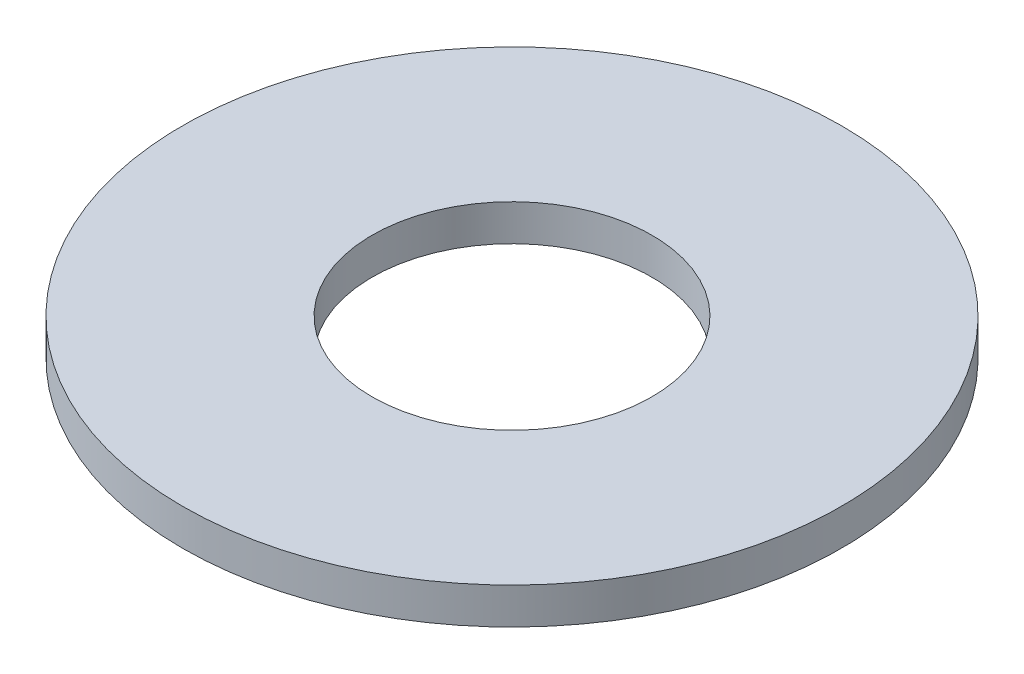
ISO-10303-21;
HEADER;
FILE_DESCRIPTION(('STEP AP214'),'2;1');
FILE_NAME('part.step','',(''),(''),'','','');
FILE_SCHEMA(('AUTOMOTIVE_DESIGN { 1 0 10303 214 1 1 1 1 }'));
ENDSEC;
DATA;
#1=APPLICATION_CONTEXT('core data for automotive mechanical design processes');
#2=APPLICATION_PROTOCOL_DEFINITION('international standard','automotive_design',2000,#1);
#3=PRODUCT_CONTEXT('',#1,'mechanical');
#4=PRODUCT('Part','Part','',(#3));
#5=PRODUCT_RELATED_PRODUCT_CATEGORY('part','',(#4));
#6=PRODUCT_DEFINITION_FORMATION('','',#4);
#7=PRODUCT_DEFINITION_CONTEXT('part definition',#1,'design');
#8=PRODUCT_DEFINITION('design','',#6,#7);
#9=PRODUCT_DEFINITION_SHAPE('','',#8);
#10=(LENGTH_UNIT() NAMED_UNIT(*) SI_UNIT(.MILLI.,.METRE.));
#11=(NAMED_UNIT(*) PLANE_ANGLE_UNIT() SI_UNIT($,.RADIAN.));
#12=(NAMED_UNIT(*) SI_UNIT($,.STERADIAN.) SOLID_ANGLE_UNIT());
#13=UNCERTAINTY_MEASURE_WITH_UNIT(LENGTH_MEASURE(1.E-05),#10,'distance_accuracy_value','');
#14=(GEOMETRIC_REPRESENTATION_CONTEXT(3) GLOBAL_UNCERTAINTY_ASSIGNED_CONTEXT((#13)) GLOBAL_UNIT_ASSIGNED_CONTEXT((#10,
#11,#12)) REPRESENTATION_CONTEXT('',''));
#15=CARTESIAN_POINT('',(0.,0.,0.));
#16=DIRECTION('',(0.,0.,1.));
#17=DIRECTION('',(1.,0.,0.));
#18=AXIS2_PLACEMENT_3D('',#15,#16,#17);
#19=CARTESIAN_POINT('',(0.,1.7526,0.));
#20=DIRECTION('',(0.,-1.,0.));
#21=DIRECTION('',(0.,0.,-1.));
#22=AXIS2_PLACEMENT_3D('',#19,#20,#21);
#23=CYLINDRICAL_SURFACE('',#22,15.875);
#24=CARTESIAN_POINT('',(0.,1.7526,0.));
#25=DIRECTION('',(0.,1.,0.));
#26=DIRECTION('',(0.,0.,1.));
#27=AXIS2_PLACEMENT_3D('',#24,#25,#26);
#28=CIRCLE('',#27,15.875);
#29=CARTESIAN_POINT('',(0.,1.7526,15.875));
#30=VERTEX_POINT('',#29);
#31=EDGE_CURVE('E10',#30,#30,#28,.T.);
#32=ORIENTED_EDGE('',*,*,#31,.F.);
#33=EDGE_LOOP('',(#32));
#34=FACE_BOUND('',#33,.T.);
#35=CARTESIAN_POINT('',(0.,0.,0.));
#36=DIRECTION('',(0.,1.,0.));
#37=DIRECTION('',(0.,0.,1.));
#38=AXIS2_PLACEMENT_3D('',#35,#36,#37);
#39=CIRCLE('',#38,15.875);
#40=CARTESIAN_POINT('',(0.,0.,15.875));
#41=VERTEX_POINT('',#40);
#42=EDGE_CURVE('E36',#41,#41,#39,.T.);
#43=ORIENTED_EDGE('',*,*,#42,.T.);
#44=EDGE_LOOP('',(#43));
#45=FACE_BOUND('',#44,.T.);
#46=ADVANCED_FACE('F33',(#34,#45),#23,.T.);
#47=CARTESIAN_POINT('',(0.,1.7526,0.));
#48=DIRECTION('',(0.,1.,0.));
#49=DIRECTION('',(0.,0.,1.));
#50=AXIS2_PLACEMENT_3D('',#47,#48,#49);
#51=PLANE('',#50);
#52=CARTESIAN_POINT('',(0.,1.7526,0.));
#53=DIRECTION('',(0.,1.,0.));
#54=DIRECTION('',(0.,0.,1.));
#55=AXIS2_PLACEMENT_3D('',#52,#53,#54);
#56=CIRCLE('',#55,6.7437);
#57=CARTESIAN_POINT('',(0.,1.7526,6.7437));
#58=VERTEX_POINT('',#57);
#59=EDGE_CURVE('E45',#58,#58,#56,.T.);
#60=ORIENTED_EDGE('',*,*,#59,.F.);
#61=EDGE_LOOP('',(#60));
#62=FACE_BOUND('',#61,.T.);
#63=ORIENTED_EDGE('',*,*,#31,.T.);
#64=EDGE_LOOP('',(#63));
#65=FACE_BOUND('',#64,.T.);
#66=ADVANCED_FACE('F60',(#62,#65),#51,.T.);
#67=CARTESIAN_POINT('',(0.,0.,0.));
#68=DIRECTION('',(0.,1.,0.));
#69=DIRECTION('',(0.,0.,1.));
#70=AXIS2_PLACEMENT_3D('',#67,#68,#69);
#71=PLANE('',#70);
#72=CARTESIAN_POINT('',(0.,0.,0.));
#73=DIRECTION('',(0.,1.,0.));
#74=DIRECTION('',(0.,0.,1.));
#75=AXIS2_PLACEMENT_3D('',#72,#73,#74);
#76=CIRCLE('',#75,6.7437);
#77=CARTESIAN_POINT('',(0.,0.,6.7437));
#78=VERTEX_POINT('',#77);
#79=EDGE_CURVE('E43',#78,#78,#76,.T.);
#80=ORIENTED_EDGE('',*,*,#79,.T.);
#81=EDGE_LOOP('',(#80));
#82=FACE_BOUND('',#81,.T.);
#83=ORIENTED_EDGE('',*,*,#42,.F.);
#84=EDGE_LOOP('',(#83));
#85=FACE_BOUND('',#84,.T.);
#86=ADVANCED_FACE('F51',(#82,#85),#71,.F.);
#87=CARTESIAN_POINT('',(0.,0.,0.));
#88=DIRECTION('',(0.,1.,0.));
#89=DIRECTION('',(0.,0.,1.));
#90=AXIS2_PLACEMENT_3D('',#87,#88,#89);
#91=CYLINDRICAL_SURFACE('',#90,6.7437);
#92=ORIENTED_EDGE('',*,*,#79,.F.);
#93=EDGE_LOOP('',(#92));
#94=FACE_BOUND('',#93,.T.);
#95=ORIENTED_EDGE('',*,*,#59,.T.);
#96=EDGE_LOOP('',(#95));
#97=FACE_BOUND('',#96,.T.);
#98=ADVANCED_FACE('F54',(#94,#97),#91,.F.);
#99=CLOSED_SHELL('',(#46,#66,#86,#98));
#100=MANIFOLD_SOLID_BREP('B2',#99);
#101=ADVANCED_BREP_SHAPE_REPRESENTATION('',(#18,#100),#14);
#102=SHAPE_DEFINITION_REPRESENTATION(#9,#101);
ENDSEC;
END-ISO-10303-21;
